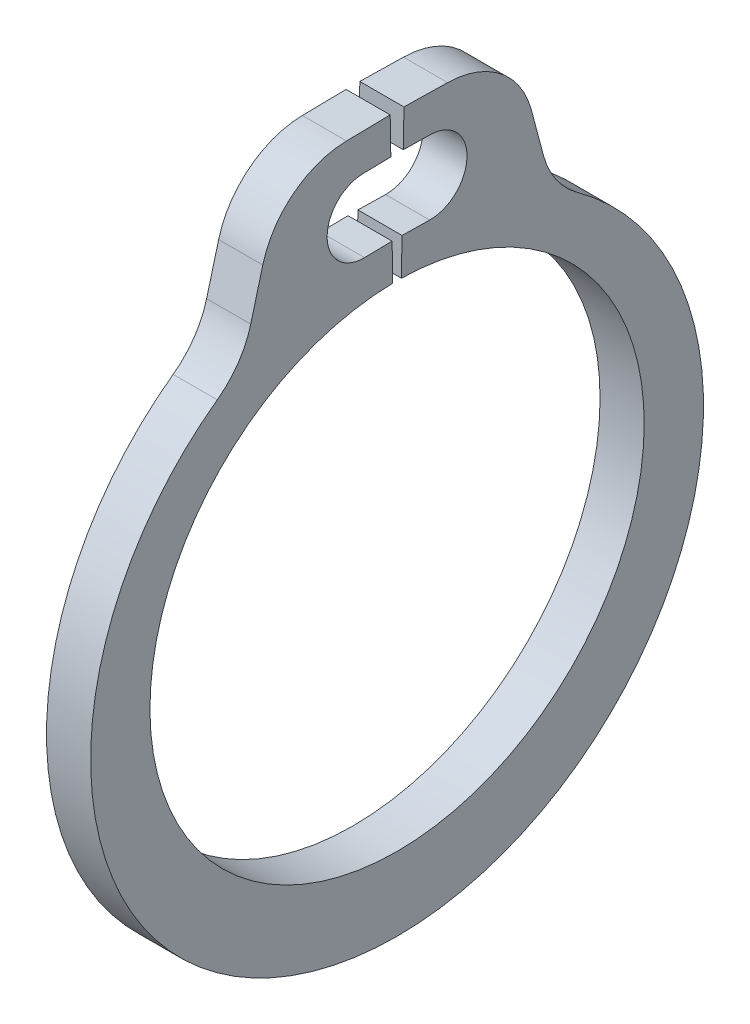
ISO-10303-21;
HEADER;
FILE_DESCRIPTION(('STEP AP214'),'2;1');
FILE_NAME('part.step','',(''),(''),'','','');
FILE_SCHEMA(('AUTOMOTIVE_DESIGN { 1 0 10303 214 1 1 1 1 }'));
ENDSEC;
DATA;
#1=APPLICATION_CONTEXT('core data for automotive mechanical design processes');
#2=APPLICATION_PROTOCOL_DEFINITION('international standard','automotive_design',2000,#1);
#3=PRODUCT_CONTEXT('',#1,'mechanical');
#4=PRODUCT('Part','Part','',(#3));
#5=PRODUCT_RELATED_PRODUCT_CATEGORY('part','',(#4));
#6=PRODUCT_DEFINITION_FORMATION('','',#4);
#7=PRODUCT_DEFINITION_CONTEXT('part definition',#1,'design');
#8=PRODUCT_DEFINITION('design','',#6,#7);
#9=PRODUCT_DEFINITION_SHAPE('','',#8);
#10=(LENGTH_UNIT() NAMED_UNIT(*) SI_UNIT(.MILLI.,.METRE.));
#11=(NAMED_UNIT(*) PLANE_ANGLE_UNIT() SI_UNIT($,.RADIAN.));
#12=(NAMED_UNIT(*) SI_UNIT($,.STERADIAN.) SOLID_ANGLE_UNIT());
#13=UNCERTAINTY_MEASURE_WITH_UNIT(LENGTH_MEASURE(1.E-05),#10,'distance_accuracy_value','');
#14=(GEOMETRIC_REPRESENTATION_CONTEXT(3) GLOBAL_UNCERTAINTY_ASSIGNED_CONTEXT((#13)) GLOBAL_UNIT_ASSIGNED_CONTEXT((#10,
#11,#12)) REPRESENTATION_CONTEXT('',''));
#15=CARTESIAN_POINT('',(0.,0.,0.));
#16=DIRECTION('',(0.,0.,1.));
#17=DIRECTION('',(1.,0.,0.));
#18=AXIS2_PLACEMENT_3D('',#15,#16,#17);
#19=CARTESIAN_POINT('',(0.190499999999996,0.,0.));
#20=DIRECTION('',(-1.,0.,0.));
#21=DIRECTION('',(0.,0.,1.));
#22=AXIS2_PLACEMENT_3D('',#19,#20,#21);
#23=CYLINDRICAL_SURFACE('',#22,2.1336);
#24=CARTESIAN_POINT('',(-0.190499999999996,0.,0.));
#25=DIRECTION('',(-1.,0.,0.));
#26=DIRECTION('',(0.,0.,-1.));
#27=AXIS2_PLACEMENT_3D('',#24,#25,#26);
#28=CIRCLE('',#27,2.1336);
#29=CARTESIAN_POINT('',(-0.190499999999996,2.13327504238568,-0.0372364543745896));
#30=VERTEX_POINT('',#29);
#31=CARTESIAN_POINT('',(-0.190499999999996,2.13327504238568,0.0372364543745896));
#32=VERTEX_POINT('',#31);
#33=EDGE_CURVE('E197',#30,#32,#28,.T.);
#34=ORIENTED_EDGE('',*,*,#33,.T.);
#35=DIRECTION('',(-1.,0.,0.));
#36=VECTOR('',#35,1.);
#37=CARTESIAN_POINT('',(0.190499999999996,2.13327504238568,0.0372364543745896));
#38=LINE('',#37,#36);
#39=CARTESIAN_POINT('',(0.190499999999996,2.13327504238568,0.0372364543745896));
#40=VERTEX_POINT('',#39);
#41=EDGE_CURVE('E179',#40,#32,#38,.T.);
#42=ORIENTED_EDGE('',*,*,#41,.F.);
#43=CARTESIAN_POINT('',(0.190499999999996,0.,0.));
#44=DIRECTION('',(-1.,0.,0.));
#45=DIRECTION('',(0.,0.,-1.));
#46=AXIS2_PLACEMENT_3D('',#43,#44,#45);
#47=CIRCLE('',#46,2.1336);
#48=CARTESIAN_POINT('',(0.190499999999996,2.13327504238568,-0.0372364543745896));
#49=VERTEX_POINT('',#48);
#50=EDGE_CURVE('E185',#49,#40,#47,.T.);
#51=ORIENTED_EDGE('',*,*,#50,.F.);
#52=DIRECTION('',(-1.,0.,0.));
#53=VECTOR('',#52,1.);
#54=CARTESIAN_POINT('',(0.190499999999996,2.13327504238568,-0.0372364543745896));
#55=LINE('',#54,#53);
#56=EDGE_CURVE('E275',#49,#30,#55,.T.);
#57=ORIENTED_EDGE('',*,*,#56,.T.);
#58=EDGE_LOOP('',(#34,#42,#51,#57));
#59=FACE_BOUND('',#58,.T.);
#60=ADVANCED_FACE('F36',(#59),#23,.F.);
#61=CARTESIAN_POINT('',(0.190499999999996,2.45072668559783,0.0427775934184263));
#62=DIRECTION('',(0.,-0.0174524064372838,0.999847695156391));
#63=DIRECTION('',(0.,-0.999847695156391,-0.0174524064372838));
#64=AXIS2_PLACEMENT_3D('',#61,#62,#63);
#65=PLANE('',#64);
#66=DIRECTION('',(0.,0.999847695156391,0.0174524064372838));
#67=VECTOR('',#66,1.);
#68=CARTESIAN_POINT('',(-0.190499999999996,2.45072668559783,0.0427775934184263));
#69=LINE('',#68,#67);
#70=CARTESIAN_POINT('',(-0.190499999999996,2.45072668559783,0.0427775934184263));
#71=VERTEX_POINT('',#70);
#72=EDGE_CURVE('E277',#32,#71,#69,.T.);
#73=ORIENTED_EDGE('',*,*,#72,.T.);
#74=DIRECTION('',(-1.,0.,0.));
#75=VECTOR('',#74,1.);
#76=CARTESIAN_POINT('',(0.190499999999996,2.45072668559783,0.0427775934184263));
#77=LINE('',#76,#75);
#78=CARTESIAN_POINT('',(0.190499999999996,2.45072668559783,0.0427775934184263));
#79=VERTEX_POINT('',#78);
#80=EDGE_CURVE('E182',#79,#71,#77,.T.);
#81=ORIENTED_EDGE('',*,*,#80,.F.);
#82=DIRECTION('',(0.,0.999847695156391,0.0174524064372838));
#83=VECTOR('',#82,1.);
#84=CARTESIAN_POINT('',(0.190499999999996,2.45072668559783,0.0427775934184263));
#85=LINE('',#84,#83);
#86=EDGE_CURVE('E175',#40,#79,#85,.T.);
#87=ORIENTED_EDGE('',*,*,#86,.F.);
#88=ORIENTED_EDGE('',*,*,#41,.T.);
#89=EDGE_LOOP('',(#73,#81,#87,#88));
#90=FACE_BOUND('',#89,.T.);
#91=ADVANCED_FACE('F177',(#90),#65,.F.);
#92=CARTESIAN_POINT('',(0.190499999999996,2.45072668559783,0.0427775934184263));
#93=DIRECTION('',(0.,-0.999847695156391,-0.0174524064372829));
#94=DIRECTION('',(0.,0.0174524064372829,-0.999847695156391));
#95=AXIS2_PLACEMENT_3D('',#92,#93,#94);
#96=PLANE('',#95);
#97=DIRECTION('',(0.,-0.0174524064372829,0.999847695156391));
#98=VECTOR('',#97,1.);
#99=CARTESIAN_POINT('',(-0.190499999999996,2.45072668559783,0.0427775934184263));
#100=LINE('',#99,#98);
#101=CARTESIAN_POINT('',(-0.190499999999996,2.44657083131495,0.28086632582754));
#102=VERTEX_POINT('',#101);
#103=EDGE_CURVE('E279',#71,#102,#100,.T.);
#104=ORIENTED_EDGE('',*,*,#103,.T.);
#105=DIRECTION('',(-1.,0.,0.));
#106=VECTOR('',#105,1.);
#107=CARTESIAN_POINT('',(0.190499999999996,2.44657083131495,0.28086632582754));
#108=LINE('',#107,#106);
#109=CARTESIAN_POINT('',(0.190499999999996,2.44657083131495,0.28086632582754));
#110=VERTEX_POINT('',#109);
#111=EDGE_CURVE('E202',#110,#102,#108,.T.);
#112=ORIENTED_EDGE('',*,*,#111,.F.);
#113=DIRECTION('',(0.,-0.0174524064372829,0.999847695156391));
#114=VECTOR('',#113,1.);
#115=CARTESIAN_POINT('',(0.190499999999996,2.45072668559783,0.0427775934184263));
#116=LINE('',#115,#114);
#117=EDGE_CURVE('E184',#79,#110,#116,.T.);
#118=ORIENTED_EDGE('',*,*,#117,.F.);
#119=ORIENTED_EDGE('',*,*,#80,.T.);
#120=EDGE_LOOP('',(#104,#112,#118,#119));
#121=FACE_BOUND('',#120,.T.);
#122=ADVANCED_FACE('F381',(#121),#96,.F.);
#123=CARTESIAN_POINT('',(0.190499999999996,2.76402247452711,0.28640746487138));
#124=DIRECTION('',(-1.,0.,0.));
#125=DIRECTION('',(0.,0.,1.));
#126=AXIS2_PLACEMENT_3D('',#123,#124,#125);
#127=CYLINDRICAL_SURFACE('',#126,0.3175);
#128=CARTESIAN_POINT('',(-0.190499999999996,2.76402247452711,0.28640746487138));
#129=DIRECTION('',(-1.,0.,0.));
#130=DIRECTION('',(0.,0.,1.));
#131=AXIS2_PLACEMENT_3D('',#128,#129,#130);
#132=CIRCLE('',#131,0.3175);
#133=CARTESIAN_POINT('',(-0.190499999999996,3.08147411773926,0.291948603915217));
#134=VERTEX_POINT('',#133);
#135=EDGE_CURVE('E281',#102,#134,#132,.T.);
#136=ORIENTED_EDGE('',*,*,#135,.T.);
#137=DIRECTION('',(-1.,0.,0.));
#138=VECTOR('',#137,1.);
#139=CARTESIAN_POINT('',(0.190499999999996,3.08147411773926,0.291948603915217));
#140=LINE('',#139,#138);
#141=CARTESIAN_POINT('',(0.190499999999996,3.08147411773926,0.291948603915217));
#142=VERTEX_POINT('',#141);
#143=EDGE_CURVE('E325',#142,#134,#140,.T.);
#144=ORIENTED_EDGE('',*,*,#143,.F.);
#145=CARTESIAN_POINT('',(0.190499999999996,2.76402247452711,0.28640746487138));
#146=DIRECTION('',(-1.,0.,0.));
#147=DIRECTION('',(0.,0.,1.));
#148=AXIS2_PLACEMENT_3D('',#145,#146,#147);
#149=CIRCLE('',#148,0.3175);
#150=EDGE_CURVE('E334',#110,#142,#149,.T.);
#151=ORIENTED_EDGE('',*,*,#150,.F.);
#152=ORIENTED_EDGE('',*,*,#111,.T.);
#153=EDGE_LOOP('',(#136,#144,#151,#152));
#154=FACE_BOUND('',#153,.T.);
#155=ADVANCED_FACE('F332',(#154),#127,.F.);
#156=CARTESIAN_POINT('',(0.190499999999996,3.08562997202214,0.0538598715060998));
#157=DIRECTION('',(0.,0.999847695156391,0.0174524064372829));
#158=DIRECTION('',(0.,-0.0174524064372829,0.999847695156391));
#159=AXIS2_PLACEMENT_3D('',#156,#157,#158);
#160=PLANE('',#159);
#161=DIRECTION('',(0.,0.0174524064372829,-0.999847695156391));
#162=VECTOR('',#161,1.);
#163=CARTESIAN_POINT('',(-0.190499999999996,3.08562997202214,0.0538598715060998));
#164=LINE('',#163,#162);
#165=CARTESIAN_POINT('',(-0.190499999999996,3.08562997202214,0.0538598715060998));
#166=VERTEX_POINT('',#165);
#167=EDGE_CURVE('E283',#134,#166,#164,.T.);
#168=ORIENTED_EDGE('',*,*,#167,.T.);
#169=DIRECTION('',(-1.,0.,0.));
#170=VECTOR('',#169,1.);
#171=CARTESIAN_POINT('',(0.190499999999996,3.08562997202214,0.0538598715060998));
#172=LINE('',#171,#170);
#173=CARTESIAN_POINT('',(0.190499999999996,3.08562997202214,0.0538598715060998));
#174=VERTEX_POINT('',#173);
#175=EDGE_CURVE('E322',#174,#166,#172,.T.);
#176=ORIENTED_EDGE('',*,*,#175,.F.);
#177=DIRECTION('',(0.,0.0174524064372829,-0.999847695156391));
#178=VECTOR('',#177,1.);
#179=CARTESIAN_POINT('',(0.190499999999996,3.08562997202214,0.0538598715060998));
#180=LINE('',#179,#178);
#181=EDGE_CURVE('E350',#142,#174,#180,.T.);
#182=ORIENTED_EDGE('',*,*,#181,.F.);
#183=ORIENTED_EDGE('',*,*,#143,.T.);
#184=EDGE_LOOP('',(#168,#176,#182,#183));
#185=FACE_BOUND('',#184,.T.);
#186=ADVANCED_FACE('F342',(#185),#160,.F.);
#187=CARTESIAN_POINT('',(0.190499999999996,3.08562997202214,0.0538598715060998));
#188=DIRECTION('',(0.,-0.0174524064372832,0.999847695156391));
#189=DIRECTION('',(0.,-0.999847695156391,-0.0174524064372832));
#190=AXIS2_PLACEMENT_3D('',#187,#188,#189);
#191=PLANE('',#190);
#192=DIRECTION('',(0.,0.999847695156391,0.0174524064372832));
#193=VECTOR('',#192,1.);
#194=CARTESIAN_POINT('',(-0.190499999999996,3.08562997202214,0.0538598715060998));
#195=LINE('',#194,#193);
#196=CARTESIAN_POINT('',(-0.190499999999996,3.4030816152343,0.0594010105499365));
#197=VERTEX_POINT('',#196);
#198=EDGE_CURVE('E285',#166,#197,#195,.T.);
#199=ORIENTED_EDGE('',*,*,#198,.T.);
#200=DIRECTION('',(-1.,0.,0.));
#201=VECTOR('',#200,1.);
#202=CARTESIAN_POINT('',(0.190499999999996,3.4030816152343,0.0594010105499365));
#203=LINE('',#202,#201);
#204=CARTESIAN_POINT('',(0.190499999999996,3.4030816152343,0.0594010105499365));
#205=VERTEX_POINT('',#204);
#206=EDGE_CURVE('E319',#205,#197,#203,.T.);
#207=ORIENTED_EDGE('',*,*,#206,.F.);
#208=DIRECTION('',(0.,0.999847695156391,0.0174524064372832));
#209=VECTOR('',#208,1.);
#210=CARTESIAN_POINT('',(0.190499999999996,3.08562997202214,0.0538598715060998));
#211=LINE('',#210,#209);
#212=EDGE_CURVE('E348',#174,#205,#211,.T.);
#213=ORIENTED_EDGE('',*,*,#212,.F.);
#214=ORIENTED_EDGE('',*,*,#175,.T.);
#215=EDGE_LOOP('',(#199,#207,#213,#214));
#216=FACE_BOUND('',#215,.T.);
#217=ADVANCED_FACE('F346',(#216),#191,.F.);
#218=CARTESIAN_POINT('',(0.190499999999996,3.4030816152343,0.0594010105499365));
#219=DIRECTION('',(0.,-0.999847695156391,-0.0174524064372833));
#220=DIRECTION('',(0.,0.0174524064372833,-0.999847695156391));
#221=AXIS2_PLACEMENT_3D('',#218,#219,#220);
#222=PLANE('',#221);
#223=DIRECTION('',(0.,-0.0174524064372833,0.999847695156391));
#224=VECTOR('',#223,1.);
#225=CARTESIAN_POINT('',(-0.190499999999996,3.4030816152343,0.0594010105499365));
#226=LINE('',#225,#224);
#227=CARTESIAN_POINT('',(-0.190499999999996,3.39650096805663,0.436406034863775));
#228=VERTEX_POINT('',#227);
#229=EDGE_CURVE('E287',#197,#228,#226,.T.);
#230=ORIENTED_EDGE('',*,*,#229,.T.);
#231=DIRECTION('',(-1.,0.,0.));
#232=VECTOR('',#231,1.);
#233=CARTESIAN_POINT('',(0.190499999999996,3.39650096805663,0.436406034863775));
#234=LINE('',#233,#232);
#235=CARTESIAN_POINT('',(0.190499999999996,3.39650096805663,0.436406034863775));
#236=VERTEX_POINT('',#235);
#237=EDGE_CURVE('E59',#228,#236,#234,.F.);
#238=ORIENTED_EDGE('',*,*,#237,.T.);
#239=DIRECTION('',(0.,-0.0174524064372833,0.999847695156391));
#240=VECTOR('',#239,1.);
#241=CARTESIAN_POINT('',(0.190499999999996,3.4030816152343,0.0594010105499365));
#242=LINE('',#241,#240);
#243=EDGE_CURVE('E349',#205,#236,#242,.T.);
#244=ORIENTED_EDGE('',*,*,#243,.F.);
#245=ORIENTED_EDGE('',*,*,#206,.T.);
#246=EDGE_LOOP('',(#230,#238,#244,#245));
#247=FACE_BOUND('',#246,.T.);
#248=ADVANCED_FACE('F367',(#247),#222,.F.);
#249=CARTESIAN_POINT('',(0.190499999999996,3.38645819810278,1.0117559401864));
#250=DIRECTION('',(0.,-0.256832135818306,-0.966456027975928));
#251=DIRECTION('',(0.,0.966456027975928,-0.256832135818306));
#252=AXIS2_PLACEMENT_3D('',#249,#250,#251);
#253=PLANE('',#252);
#254=DIRECTION('',(0.,-0.966456027975928,0.256832135818306));
#255=VECTOR('',#254,1.);
#256=CARTESIAN_POINT('',(-0.190499999999996,3.38645819810278,1.0117559401864));
#257=LINE('',#256,#255);
#258=CARTESIAN_POINT('',(-0.190499999999996,2.83032311184101,1.15954679447622));
#259=VERTEX_POINT('',#258);
#260=CARTESIAN_POINT('',(-0.190499999999996,2.44016753972551,1.26322920318104));
#261=VERTEX_POINT('',#260);
#262=EDGE_CURVE('E249',#259,#261,#257,.T.);
#263=ORIENTED_EDGE('',*,*,#262,.T.);
#264=DIRECTION('',(1.,0.,0.));
#265=VECTOR('',#264,1.);
#266=CARTESIAN_POINT('',(0.190499999999996,2.44016753972551,1.26322920318104));
#267=LINE('',#266,#265);
#268=CARTESIAN_POINT('',(0.190499999999996,2.44016753972551,1.26322920318104));
#269=VERTEX_POINT('',#268);
#270=EDGE_CURVE('E211',#261,#269,#267,.T.);
#271=ORIENTED_EDGE('',*,*,#270,.T.);
#272=DIRECTION('',(0.,-0.966456027975928,0.256832135818306));
#273=VECTOR('',#272,1.);
#274=CARTESIAN_POINT('',(0.190499999999996,3.38645819810278,1.0117559401864));
#275=LINE('',#274,#273);
#276=CARTESIAN_POINT('',(0.190499999999996,2.83032311184101,1.15954679447622));
#277=VERTEX_POINT('',#276);
#278=EDGE_CURVE('E263',#277,#269,#275,.T.);
#279=ORIENTED_EDGE('',*,*,#278,.F.);
#280=DIRECTION('',(-1.,0.,0.));
#281=VECTOR('',#280,1.);
#282=CARTESIAN_POINT('',(0.190499999999996,2.83032311184101,1.15954679447622));
#283=LINE('',#282,#281);
#284=EDGE_CURVE('E208',#277,#259,#283,.T.);
#285=ORIENTED_EDGE('',*,*,#284,.T.);
#286=EDGE_LOOP('',(#263,#271,#279,#285));
#287=FACE_BOUND('',#286,.T.);
#288=ADVANCED_FACE('F364',(#287),#253,.F.);
#289=CARTESIAN_POINT('',(0.190499999999996,-0.123136153446834,0.));
#290=DIRECTION('',(-1.,0.,0.));
#291=DIRECTION('',(0.,0.,1.));
#292=AXIS2_PLACEMENT_3D('',#289,#290,#291);
#293=CYLINDRICAL_SURFACE('',#292,2.64546384655316);
#294=CARTESIAN_POINT('',(0.190499999999996,-0.123136153446834,0.));
#295=DIRECTION('',(1.,0.,0.));
#296=DIRECTION('',(0.,0.,-1.));
#297=AXIS2_PLACEMENT_3D('',#294,#295,#296);
#298=CIRCLE('',#297,2.64546384655316);
#299=CARTESIAN_POINT('',(0.190499999999996,2.01888528998576,1.55248932340766));
#300=VERTEX_POINT('',#299);
#301=CARTESIAN_POINT('',(0.190499999999996,2.01888528998576,-1.55248932340766));
#302=VERTEX_POINT('',#301);
#303=EDGE_CURVE('E255',#300,#302,#298,.T.);
#304=ORIENTED_EDGE('',*,*,#303,.F.);
#305=DIRECTION('',(-1.,0.,0.));
#306=VECTOR('',#305,1.);
#307=CARTESIAN_POINT('',(0.190499999999996,2.01888528998576,1.55248932340766));
#308=LINE('',#307,#306);
#309=CARTESIAN_POINT('',(-0.190499999999996,2.01888528998576,1.55248932340766));
#310=VERTEX_POINT('',#309);
#311=EDGE_CURVE('E200',#300,#310,#308,.T.);
#312=ORIENTED_EDGE('',*,*,#311,.T.);
#313=CARTESIAN_POINT('',(-0.190499999999996,-0.123136153446834,0.));
#314=DIRECTION('',(1.,0.,0.));
#315=DIRECTION('',(0.,0.,-1.));
#316=AXIS2_PLACEMENT_3D('',#313,#314,#315);
#317=CIRCLE('',#316,2.64546384655316);
#318=CARTESIAN_POINT('',(-0.190499999999996,2.01888528998576,-1.55248932340766));
#319=VERTEX_POINT('',#318);
#320=EDGE_CURVE('E238',#310,#319,#317,.T.);
#321=ORIENTED_EDGE('',*,*,#320,.T.);
#322=DIRECTION('',(-1.,0.,0.));
#323=VECTOR('',#322,1.);
#324=CARTESIAN_POINT('',(0.190499999999996,2.01888528998576,-1.55248932340766));
#325=LINE('',#324,#323);
#326=EDGE_CURVE('E198',#319,#302,#325,.F.);
#327=ORIENTED_EDGE('',*,*,#326,.T.);
#328=EDGE_LOOP('',(#304,#312,#321,#327));
#329=FACE_BOUND('',#328,.T.);
#330=ADVANCED_FACE('F246',(#329),#293,.T.);
#331=CARTESIAN_POINT('',(0.190499999999996,3.38645819810278,-1.0117559401864));
#332=DIRECTION('',(0.,-0.256832135818306,0.966456027975928));
#333=DIRECTION('',(0.,-0.966456027975928,-0.256832135818306));
#334=AXIS2_PLACEMENT_3D('',#331,#332,#333);
#335=PLANE('',#334);
#336=DIRECTION('',(0.,0.966456027975928,0.256832135818306));
#337=VECTOR('',#336,1.);
#338=CARTESIAN_POINT('',(0.190499999999996,3.38645819810278,-1.0117559401864));
#339=LINE('',#338,#337);
#340=CARTESIAN_POINT('',(0.190499999999996,2.44016753972551,-1.26322920318104));
#341=VERTEX_POINT('',#340);
#342=CARTESIAN_POINT('',(0.190499999999996,2.83032311184101,-1.15954679447622));
#343=VERTEX_POINT('',#342);
#344=EDGE_CURVE('E254',#341,#343,#339,.T.);
#345=ORIENTED_EDGE('',*,*,#344,.F.);
#346=DIRECTION('',(1.,0.,0.));
#347=VECTOR('',#346,1.);
#348=CARTESIAN_POINT('',(-0.190499999999996,2.44016753972551,-1.26322920318104));
#349=LINE('',#348,#347);
#350=CARTESIAN_POINT('',(-0.190499999999996,2.44016753972551,-1.26322920318104));
#351=VERTEX_POINT('',#350);
#352=EDGE_CURVE('E215',#341,#351,#349,.F.);
#353=ORIENTED_EDGE('',*,*,#352,.T.);
#354=DIRECTION('',(0.,0.966456027975928,0.256832135818306));
#355=VECTOR('',#354,1.);
#356=CARTESIAN_POINT('',(-0.190499999999996,3.38645819810278,-1.0117559401864));
#357=LINE('',#356,#355);
#358=CARTESIAN_POINT('',(-0.190499999999996,2.83032311184101,-1.15954679447622));
#359=VERTEX_POINT('',#358);
#360=EDGE_CURVE('E240',#351,#359,#357,.T.);
#361=ORIENTED_EDGE('',*,*,#360,.T.);
#362=DIRECTION('',(-1.,0.,0.));
#363=VECTOR('',#362,1.);
#364=CARTESIAN_POINT('',(0.190499999999996,2.83032311184101,-1.15954679447622));
#365=LINE('',#364,#363);
#366=EDGE_CURVE('E213',#359,#343,#365,.F.);
#367=ORIENTED_EDGE('',*,*,#366,.T.);
#368=EDGE_LOOP('',(#345,#353,#361,#367));
#369=FACE_BOUND('',#368,.T.);
#370=ADVANCED_FACE('F257',(#369),#335,.F.);
#371=CARTESIAN_POINT('',(0.190499999999996,3.4030816152343,-0.0594010105499365));
#372=DIRECTION('',(0.,-0.999847695156391,0.0174524064372829));
#373=DIRECTION('',(0.,-0.0174524064372829,-0.999847695156391));
#374=AXIS2_PLACEMENT_3D('',#371,#372,#373);
#375=PLANE('',#374);
#376=DIRECTION('',(0.,0.0174524064372829,0.999847695156391));
#377=VECTOR('',#376,1.);
#378=CARTESIAN_POINT('',(0.190499999999996,3.4030816152343,-0.0594010105499365));
#379=LINE('',#378,#377);
#380=CARTESIAN_POINT('',(0.190499999999996,3.39650096805663,-0.436406034863772));
#381=VERTEX_POINT('',#380);
#382=CARTESIAN_POINT('',(0.190499999999996,3.4030816152343,-0.0594010105499365));
#383=VERTEX_POINT('',#382);
#384=EDGE_CURVE('E259',#381,#383,#379,.T.);
#385=ORIENTED_EDGE('',*,*,#384,.F.);
#386=DIRECTION('',(-1.,0.,0.));
#387=VECTOR('',#386,1.);
#388=CARTESIAN_POINT('',(0.190499999999996,3.39650096805663,-0.436406034863772));
#389=LINE('',#388,#387);
#390=CARTESIAN_POINT('',(-0.190499999999996,3.39650096805663,-0.436406034863772));
#391=VERTEX_POINT('',#390);
#392=EDGE_CURVE('E226',#381,#391,#389,.T.);
#393=ORIENTED_EDGE('',*,*,#392,.T.);
#394=DIRECTION('',(0.,0.0174524064372829,0.999847695156391));
#395=VECTOR('',#394,1.);
#396=CARTESIAN_POINT('',(-0.190499999999996,3.4030816152343,-0.0594010105499365));
#397=LINE('',#396,#395);
#398=CARTESIAN_POINT('',(-0.190499999999996,3.4030816152343,-0.0594010105499365));
#399=VERTEX_POINT('',#398);
#400=EDGE_CURVE('E292',#391,#399,#397,.T.);
#401=ORIENTED_EDGE('',*,*,#400,.T.);
#402=DIRECTION('',(-1.,0.,0.));
#403=VECTOR('',#402,1.);
#404=CARTESIAN_POINT('',(0.190499999999996,3.4030816152343,-0.0594010105499365));
#405=LINE('',#404,#403);
#406=EDGE_CURVE('E316',#383,#399,#405,.T.);
#407=ORIENTED_EDGE('',*,*,#406,.F.);
#408=EDGE_LOOP('',(#385,#393,#401,#407));
#409=FACE_BOUND('',#408,.T.);
#410=ADVANCED_FACE('F398',(#409),#375,.F.);
#411=CARTESIAN_POINT('',(0.190499999999996,3.08562997202214,-0.0538598715060998));
#412=DIRECTION('',(0.,-0.0174524064372832,-0.999847695156391));
#413=DIRECTION('',(0.,0.999847695156391,-0.0174524064372832));
#414=AXIS2_PLACEMENT_3D('',#411,#412,#413);
#415=PLANE('',#414);
#416=DIRECTION('',(0.,-0.999847695156391,0.0174524064372832));
#417=VECTOR('',#416,1.);
#418=CARTESIAN_POINT('',(-0.190499999999996,3.08562997202214,-0.0538598715060998));
#419=LINE('',#418,#417);
#420=CARTESIAN_POINT('',(-0.190499999999996,3.08562997202214,-0.0538598715060998));
#421=VERTEX_POINT('',#420);
#422=EDGE_CURVE('E294',#399,#421,#419,.T.);
#423=ORIENTED_EDGE('',*,*,#422,.T.);
#424=DIRECTION('',(-1.,0.,0.));
#425=VECTOR('',#424,1.);
#426=CARTESIAN_POINT('',(0.190499999999996,3.08562997202214,-0.0538598715060998));
#427=LINE('',#426,#425);
#428=CARTESIAN_POINT('',(0.190499999999996,3.08562997202214,-0.0538598715060998));
#429=VERTEX_POINT('',#428);
#430=EDGE_CURVE('E313',#429,#421,#427,.T.);
#431=ORIENTED_EDGE('',*,*,#430,.F.);
#432=DIRECTION('',(0.,-0.999847695156391,0.0174524064372832));
#433=VECTOR('',#432,1.);
#434=CARTESIAN_POINT('',(0.190499999999996,3.08562997202214,-0.0538598715060998));
#435=LINE('',#434,#433);
#436=EDGE_CURVE('E261',#383,#429,#435,.T.);
#437=ORIENTED_EDGE('',*,*,#436,.F.);
#438=ORIENTED_EDGE('',*,*,#406,.T.);
#439=EDGE_LOOP('',(#423,#431,#437,#438));
#440=FACE_BOUND('',#439,.T.);
#441=ADVANCED_FACE('F405',(#440),#415,.F.);
#442=CARTESIAN_POINT('',(0.190499999999996,3.08562997202214,-0.0538598715060998));
#443=DIRECTION('',(0.,0.999847695156391,-0.0174524064372829));
#444=DIRECTION('',(0.,0.0174524064372829,0.999847695156391));
#445=AXIS2_PLACEMENT_3D('',#442,#443,#444);
#446=PLANE('',#445);
#447=DIRECTION('',(0.,-0.0174524064372829,-0.999847695156391));
#448=VECTOR('',#447,1.);
#449=CARTESIAN_POINT('',(-0.190499999999996,3.08562997202214,-0.0538598715060998));
#450=LINE('',#449,#448);
#451=CARTESIAN_POINT('',(-0.190499999999996,3.08147411773926,-0.291948603915217));
#452=VERTEX_POINT('',#451);
#453=EDGE_CURVE('E296',#421,#452,#450,.T.);
#454=ORIENTED_EDGE('',*,*,#453,.T.);
#455=DIRECTION('',(-1.,0.,0.));
#456=VECTOR('',#455,1.);
#457=CARTESIAN_POINT('',(0.190499999999996,3.08147411773926,-0.291948603915217));
#458=LINE('',#457,#456);
#459=CARTESIAN_POINT('',(0.190499999999996,3.08147411773926,-0.291948603915217));
#460=VERTEX_POINT('',#459);
#461=EDGE_CURVE('E310',#460,#452,#458,.T.);
#462=ORIENTED_EDGE('',*,*,#461,.F.);
#463=DIRECTION('',(0.,-0.0174524064372829,-0.999847695156391));
#464=VECTOR('',#463,1.);
#465=CARTESIAN_POINT('',(0.190499999999996,3.08562997202214,-0.0538598715060998));
#466=LINE('',#465,#464);
#467=EDGE_CURVE('E268',#429,#460,#466,.T.);
#468=ORIENTED_EDGE('',*,*,#467,.F.);
#469=ORIENTED_EDGE('',*,*,#430,.T.);
#470=EDGE_LOOP('',(#454,#462,#468,#469));
#471=FACE_BOUND('',#470,.T.);
#472=ADVANCED_FACE('F409',(#471),#446,.F.);
#473=CARTESIAN_POINT('',(0.190499999999996,2.76402247452711,-0.28640746487138));
#474=DIRECTION('',(-1.,0.,0.));
#475=DIRECTION('',(0.,0.,1.));
#476=AXIS2_PLACEMENT_3D('',#473,#474,#475);
#477=CYLINDRICAL_SURFACE('',#476,0.3175);
#478=CARTESIAN_POINT('',(-0.190499999999996,2.76402247452711,-0.28640746487138));
#479=DIRECTION('',(-1.,0.,0.));
#480=DIRECTION('',(0.,0.,-1.));
#481=AXIS2_PLACEMENT_3D('',#478,#479,#480);
#482=CIRCLE('',#481,0.3175);
#483=CARTESIAN_POINT('',(-0.190499999999996,2.44657083131495,-0.28086632582754));
#484=VERTEX_POINT('',#483);
#485=EDGE_CURVE('E298',#452,#484,#482,.T.);
#486=ORIENTED_EDGE('',*,*,#485,.T.);
#487=DIRECTION('',(-1.,0.,0.));
#488=VECTOR('',#487,1.);
#489=CARTESIAN_POINT('',(0.190499999999996,2.44657083131495,-0.28086632582754));
#490=LINE('',#489,#488);
#491=CARTESIAN_POINT('',(0.190499999999996,2.44657083131495,-0.28086632582754));
#492=VERTEX_POINT('',#491);
#493=EDGE_CURVE('E307',#492,#484,#490,.T.);
#494=ORIENTED_EDGE('',*,*,#493,.F.);
#495=CARTESIAN_POINT('',(0.190499999999996,2.76402247452711,-0.28640746487138));
#496=DIRECTION('',(-1.,0.,0.));
#497=DIRECTION('',(0.,0.,-1.));
#498=AXIS2_PLACEMENT_3D('',#495,#496,#497);
#499=CIRCLE('',#498,0.3175);
#500=EDGE_CURVE('E270',#460,#492,#499,.T.);
#501=ORIENTED_EDGE('',*,*,#500,.F.);
#502=ORIENTED_EDGE('',*,*,#461,.T.);
#503=EDGE_LOOP('',(#486,#494,#501,#502));
#504=FACE_BOUND('',#503,.T.);
#505=ADVANCED_FACE('F416',(#504),#477,.F.);
#506=CARTESIAN_POINT('',(0.190499999999996,2.45072668559783,-0.0427775934184263));
#507=DIRECTION('',(0.,-0.999847695156391,0.0174524064372829));
#508=DIRECTION('',(0.,-0.0174524064372829,-0.999847695156391));
#509=AXIS2_PLACEMENT_3D('',#506,#507,#508);
#510=PLANE('',#509);
#511=DIRECTION('',(0.,0.0174524064372829,0.999847695156391));
#512=VECTOR('',#511,1.);
#513=CARTESIAN_POINT('',(-0.190499999999996,2.45072668559783,-0.0427775934184263));
#514=LINE('',#513,#512);
#515=CARTESIAN_POINT('',(-0.190499999999996,2.45072668559783,-0.0427775934184263));
#516=VERTEX_POINT('',#515);
#517=EDGE_CURVE('E300',#484,#516,#514,.T.);
#518=ORIENTED_EDGE('',*,*,#517,.T.);
#519=DIRECTION('',(-1.,0.,0.));
#520=VECTOR('',#519,1.);
#521=CARTESIAN_POINT('',(0.190499999999996,2.45072668559783,-0.0427775934184263));
#522=LINE('',#521,#520);
#523=CARTESIAN_POINT('',(0.190499999999996,2.45072668559783,-0.0427775934184263));
#524=VERTEX_POINT('',#523);
#525=EDGE_CURVE('E304',#524,#516,#522,.T.);
#526=ORIENTED_EDGE('',*,*,#525,.F.);
#527=DIRECTION('',(0.,0.0174524064372829,0.999847695156391));
#528=VECTOR('',#527,1.);
#529=CARTESIAN_POINT('',(0.190499999999996,2.45072668559783,-0.0427775934184263));
#530=LINE('',#529,#528);
#531=EDGE_CURVE('E272',#492,#524,#530,.T.);
#532=ORIENTED_EDGE('',*,*,#531,.F.);
#533=ORIENTED_EDGE('',*,*,#493,.T.);
#534=EDGE_LOOP('',(#518,#526,#532,#533));
#535=FACE_BOUND('',#534,.T.);
#536=ADVANCED_FACE('F419',(#535),#510,.F.);
#537=CARTESIAN_POINT('',(0.190499999999996,2.45072668559783,-0.0427775934184263));
#538=DIRECTION('',(0.,-0.0174524064372838,-0.999847695156391));
#539=DIRECTION('',(0.,0.999847695156391,-0.0174524064372838));
#540=AXIS2_PLACEMENT_3D('',#537,#538,#539);
#541=PLANE('',#540);
#542=DIRECTION('',(0.,-0.999847695156391,0.0174524064372838));
#543=VECTOR('',#542,1.);
#544=CARTESIAN_POINT('',(-0.190499999999996,2.45072668559783,-0.0427775934184263));
#545=LINE('',#544,#543);
#546=EDGE_CURVE('E194',#516,#30,#545,.T.);
#547=ORIENTED_EDGE('',*,*,#546,.T.);
#548=ORIENTED_EDGE('',*,*,#56,.F.);
#549=DIRECTION('',(0.,-0.999847695156391,0.0174524064372838));
#550=VECTOR('',#549,1.);
#551=CARTESIAN_POINT('',(0.190499999999996,2.45072668559783,-0.0427775934184263));
#552=LINE('',#551,#550);
#553=EDGE_CURVE('E190',#524,#49,#552,.T.);
#554=ORIENTED_EDGE('',*,*,#553,.F.);
#555=ORIENTED_EDGE('',*,*,#525,.T.);
#556=EDGE_LOOP('',(#547,#548,#554,#555));
#557=FACE_BOUND('',#556,.T.);
#558=ADVANCED_FACE('F422',(#557),#541,.F.);
#559=CARTESIAN_POINT('',(0.190499999999996,0.,0.));
#560=DIRECTION('',(1.,0.,0.));
#561=DIRECTION('',(0.,0.,-1.));
#562=AXIS2_PLACEMENT_3D('',#559,#560,#561);
#563=PLANE('',#562);
#564=ORIENTED_EDGE('',*,*,#243,.T.);
#565=CARTESIAN_POINT('',(0.190499999999996,2.63461702434746,0.423107301158562));
#566=DIRECTION('',(1.,0.,0.));
#567=DIRECTION('',(0.,0.,-1.));
#568=AXIS2_PLACEMENT_3D('',#565,#566,#567);
#569=CIRCLE('',#568,0.762);
#570=EDGE_CURVE('E224',#236,#277,#569,.T.);
#571=ORIENTED_EDGE('',*,*,#570,.T.);
#572=ORIENTED_EDGE('',*,*,#278,.T.);
#573=CARTESIAN_POINT('',(0.190499999999996,2.63587362721907,1.9996686964987));
#574=DIRECTION('',(1.,0.,0.));
#575=DIRECTION('',(0.,0.,-1.));
#576=AXIS2_PLACEMENT_3D('',#573,#574,#575);
#577=CIRCLE('',#576,0.762);
#578=EDGE_CURVE('E231',#269,#300,#577,.F.);
#579=ORIENTED_EDGE('',*,*,#578,.T.);
#580=ORIENTED_EDGE('',*,*,#303,.T.);
#581=CARTESIAN_POINT('',(0.190499999999996,2.63587362721907,-1.9996686964987));
#582=DIRECTION('',(1.,0.,0.));
#583=DIRECTION('',(0.,0.,-1.));
#584=AXIS2_PLACEMENT_3D('',#581,#582,#583);
#585=CIRCLE('',#584,0.762);
#586=EDGE_CURVE('E11',#302,#341,#585,.F.);
#587=ORIENTED_EDGE('',*,*,#586,.T.);
#588=ORIENTED_EDGE('',*,*,#344,.T.);
#589=CARTESIAN_POINT('',(0.190499999999996,2.63461702434746,-0.423107301158562));
#590=DIRECTION('',(1.,0.,0.));
#591=DIRECTION('',(0.,0.,-1.));
#592=AXIS2_PLACEMENT_3D('',#589,#590,#591);
#593=CIRCLE('',#592,0.762);
#594=EDGE_CURVE('E51',#343,#381,#593,.T.);
#595=ORIENTED_EDGE('',*,*,#594,.T.);
#596=ORIENTED_EDGE('',*,*,#384,.T.);
#597=ORIENTED_EDGE('',*,*,#436,.T.);
#598=ORIENTED_EDGE('',*,*,#467,.T.);
#599=ORIENTED_EDGE('',*,*,#500,.T.);
#600=ORIENTED_EDGE('',*,*,#531,.T.);
#601=ORIENTED_EDGE('',*,*,#553,.T.);
#602=ORIENTED_EDGE('',*,*,#50,.T.);
#603=ORIENTED_EDGE('',*,*,#86,.T.);
#604=ORIENTED_EDGE('',*,*,#117,.T.);
#605=ORIENTED_EDGE('',*,*,#150,.T.);
#606=ORIENTED_EDGE('',*,*,#181,.T.);
#607=ORIENTED_EDGE('',*,*,#212,.T.);
#608=EDGE_LOOP('',(#564,#571,#572,#579,#580,#587,#588,#595,#596,#597,#598,#599,#600,#601,#602,
#603,#604,#605,#606,#607));
#609=FACE_BOUND('',#608,.T.);
#610=ADVANCED_FACE('F188',(#609),#563,.T.);
#611=CARTESIAN_POINT('',(-0.190499999999996,0.,0.));
#612=DIRECTION('',(1.,0.,0.));
#613=DIRECTION('',(0.,0.,-1.));
#614=AXIS2_PLACEMENT_3D('',#611,#612,#613);
#615=PLANE('',#614);
#616=ORIENTED_EDGE('',*,*,#262,.F.);
#617=CARTESIAN_POINT('',(-0.190499999999996,2.63461702434746,0.423107301158562));
#618=DIRECTION('',(1.,0.,0.));
#619=DIRECTION('',(0.,0.,-1.));
#620=AXIS2_PLACEMENT_3D('',#617,#618,#619);
#621=CIRCLE('',#620,0.762);
#622=EDGE_CURVE('E220',#259,#228,#621,.F.);
#623=ORIENTED_EDGE('',*,*,#622,.T.);
#624=ORIENTED_EDGE('',*,*,#229,.F.);
#625=ORIENTED_EDGE('',*,*,#198,.F.);
#626=ORIENTED_EDGE('',*,*,#167,.F.);
#627=ORIENTED_EDGE('',*,*,#135,.F.);
#628=ORIENTED_EDGE('',*,*,#103,.F.);
#629=ORIENTED_EDGE('',*,*,#72,.F.);
#630=ORIENTED_EDGE('',*,*,#33,.F.);
#631=ORIENTED_EDGE('',*,*,#546,.F.);
#632=ORIENTED_EDGE('',*,*,#517,.F.);
#633=ORIENTED_EDGE('',*,*,#485,.F.);
#634=ORIENTED_EDGE('',*,*,#453,.F.);
#635=ORIENTED_EDGE('',*,*,#422,.F.);
#636=ORIENTED_EDGE('',*,*,#400,.F.);
#637=CARTESIAN_POINT('',(-0.190499999999996,2.63461702434746,-0.423107301158562));
#638=DIRECTION('',(1.,0.,0.));
#639=DIRECTION('',(0.,0.,-1.));
#640=AXIS2_PLACEMENT_3D('',#637,#638,#639);
#641=CIRCLE('',#640,0.762);
#642=EDGE_CURVE('E218',#391,#359,#641,.F.);
#643=ORIENTED_EDGE('',*,*,#642,.T.);
#644=ORIENTED_EDGE('',*,*,#360,.F.);
#645=CARTESIAN_POINT('',(-0.190499999999996,2.63587362721907,-1.9996686964987));
#646=DIRECTION('',(1.,0.,0.));
#647=DIRECTION('',(0.,0.,-1.));
#648=AXIS2_PLACEMENT_3D('',#645,#646,#647);
#649=CIRCLE('',#648,0.762);
#650=EDGE_CURVE('E44',#351,#319,#649,.T.);
#651=ORIENTED_EDGE('',*,*,#650,.T.);
#652=ORIENTED_EDGE('',*,*,#320,.F.);
#653=CARTESIAN_POINT('',(-0.190499999999996,2.63587362721907,1.9996686964987));
#654=DIRECTION('',(1.,0.,0.));
#655=DIRECTION('',(0.,0.,-1.));
#656=AXIS2_PLACEMENT_3D('',#653,#654,#655);
#657=CIRCLE('',#656,0.762);
#658=EDGE_CURVE('E229',#310,#261,#657,.T.);
#659=ORIENTED_EDGE('',*,*,#658,.T.);
#660=EDGE_LOOP('',(#616,#623,#624,#625,#626,#627,#628,#629,#630,#631,#632,#633,#634,#635,#636,
#643,#644,#651,#652,#659));
#661=FACE_BOUND('',#660,.T.);
#662=ADVANCED_FACE('F237',(#661),#615,.F.);
#663=CARTESIAN_POINT('',(0.190499999999996,2.63587362721907,1.9996686964987));
#664=DIRECTION('',(-1.,0.,0.));
#665=DIRECTION('',(0.,0.,1.));
#666=AXIS2_PLACEMENT_3D('',#663,#664,#665);
#667=CYLINDRICAL_SURFACE('',#666,0.762);
#668=ORIENTED_EDGE('',*,*,#578,.F.);
#669=ORIENTED_EDGE('',*,*,#270,.F.);
#670=ORIENTED_EDGE('',*,*,#658,.F.);
#671=ORIENTED_EDGE('',*,*,#311,.F.);
#672=EDGE_LOOP('',(#668,#669,#670,#671));
#673=FACE_BOUND('',#672,.T.);
#674=ADVANCED_FACE('F363',(#673),#667,.F.);
#675=CARTESIAN_POINT('',(0.190499999999996,2.63587362721907,-1.9996686964987));
#676=DIRECTION('',(-1.,0.,0.));
#677=DIRECTION('',(0.,0.,1.));
#678=AXIS2_PLACEMENT_3D('',#675,#676,#677);
#679=CYLINDRICAL_SURFACE('',#678,0.762);
#680=ORIENTED_EDGE('',*,*,#586,.F.);
#681=ORIENTED_EDGE('',*,*,#326,.F.);
#682=ORIENTED_EDGE('',*,*,#650,.F.);
#683=ORIENTED_EDGE('',*,*,#352,.F.);
#684=EDGE_LOOP('',(#680,#681,#682,#683));
#685=FACE_BOUND('',#684,.T.);
#686=ADVANCED_FACE('F252',(#685),#679,.F.);
#687=CARTESIAN_POINT('',(0.190499999999996,2.63461702434746,0.423107301158562));
#688=DIRECTION('',(-1.,0.,0.));
#689=DIRECTION('',(0.,0.,1.));
#690=AXIS2_PLACEMENT_3D('',#687,#688,#689);
#691=CYLINDRICAL_SURFACE('',#690,0.762);
#692=ORIENTED_EDGE('',*,*,#570,.F.);
#693=ORIENTED_EDGE('',*,*,#237,.F.);
#694=ORIENTED_EDGE('',*,*,#622,.F.);
#695=ORIENTED_EDGE('',*,*,#284,.F.);
#696=EDGE_LOOP('',(#692,#693,#694,#695));
#697=FACE_BOUND('',#696,.T.);
#698=ADVANCED_FACE('F366',(#697),#691,.T.);
#699=CARTESIAN_POINT('',(0.190499999999996,2.63461702434746,-0.423107301158562));
#700=DIRECTION('',(-1.,0.,0.));
#701=DIRECTION('',(0.,0.,1.));
#702=AXIS2_PLACEMENT_3D('',#699,#700,#701);
#703=CYLINDRICAL_SURFACE('',#702,0.762);
#704=ORIENTED_EDGE('',*,*,#594,.F.);
#705=ORIENTED_EDGE('',*,*,#366,.F.);
#706=ORIENTED_EDGE('',*,*,#642,.F.);
#707=ORIENTED_EDGE('',*,*,#392,.F.);
#708=EDGE_LOOP('',(#704,#705,#706,#707));
#709=FACE_BOUND('',#708,.T.);
#710=ADVANCED_FACE('F38',(#709),#703,.T.);
#711=CLOSED_SHELL('',(#60,#91,#122,#155,#186,#217,#248,#288,#330,#370,#410,#441,#472,#505,#536,
#558,#610,#662,#674,#686,#698,#710));
#712=MANIFOLD_SOLID_BREP('B2',#711);
#713=ADVANCED_BREP_SHAPE_REPRESENTATION('',(#18,#712),#14);
#714=SHAPE_DEFINITION_REPRESENTATION(#9,#713);
ENDSEC;
END-ISO-10303-21;
